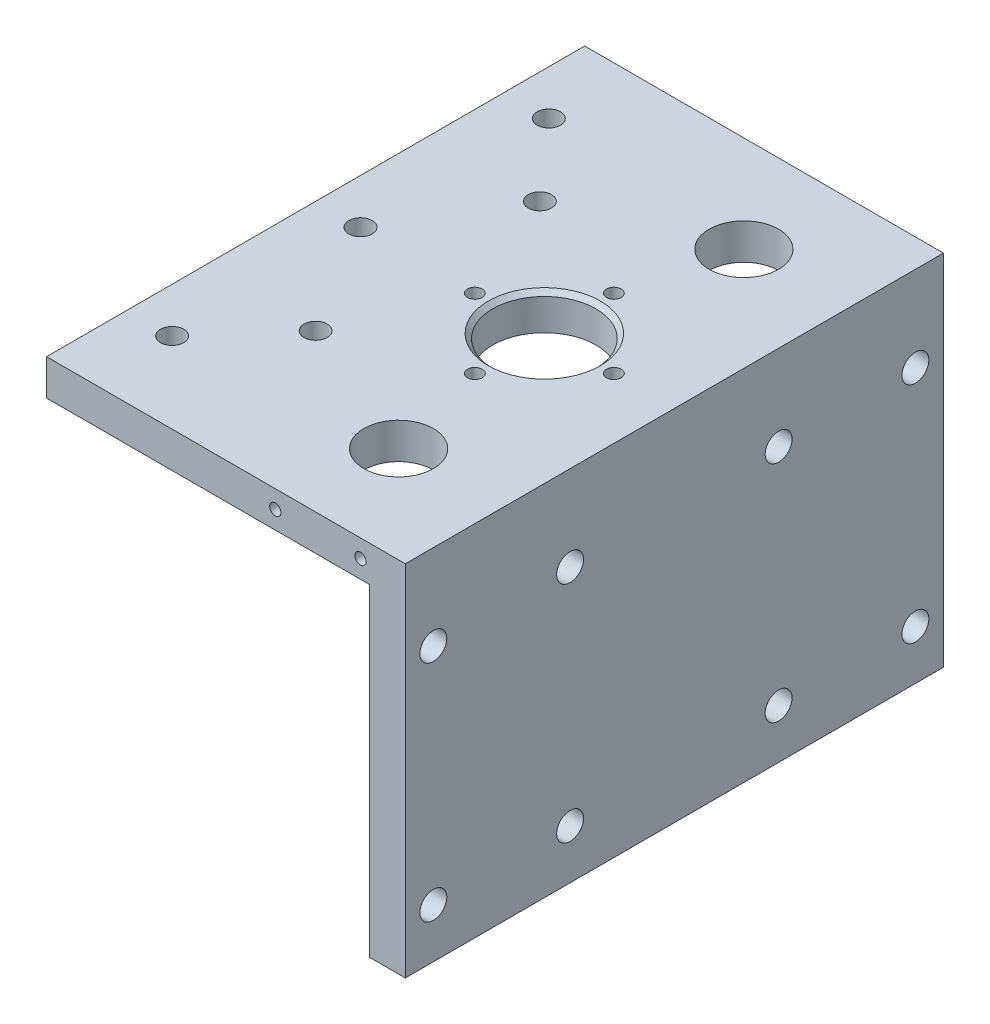
ISO-10303-21;
HEADER;
FILE_DESCRIPTION(('STEP AP214'),'2;1');
FILE_NAME('part.step','',(''),(''),'','','');
FILE_SCHEMA(('AUTOMOTIVE_DESIGN { 1 0 10303 214 1 1 1 1 }'));
ENDSEC;
DATA;
#1=APPLICATION_CONTEXT('core data for automotive mechanical design processes');
#2=APPLICATION_PROTOCOL_DEFINITION('international standard','automotive_design',2000,#1);
#3=PRODUCT_CONTEXT('',#1,'mechanical');
#4=PRODUCT('Part','Part','',(#3));
#5=PRODUCT_RELATED_PRODUCT_CATEGORY('part','',(#4));
#6=PRODUCT_DEFINITION_FORMATION('','',#4);
#7=PRODUCT_DEFINITION_CONTEXT('part definition',#1,'design');
#8=PRODUCT_DEFINITION('design','',#6,#7);
#9=PRODUCT_DEFINITION_SHAPE('','',#8);
#10=(LENGTH_UNIT() NAMED_UNIT(*) SI_UNIT(.MILLI.,.METRE.));
#11=(NAMED_UNIT(*) PLANE_ANGLE_UNIT() SI_UNIT($,.RADIAN.));
#12=(NAMED_UNIT(*) SI_UNIT($,.STERADIAN.) SOLID_ANGLE_UNIT());
#13=UNCERTAINTY_MEASURE_WITH_UNIT(LENGTH_MEASURE(1.E-05),#10,'distance_accuracy_value','');
#14=(GEOMETRIC_REPRESENTATION_CONTEXT(3) GLOBAL_UNCERTAINTY_ASSIGNED_CONTEXT((#13)) GLOBAL_UNIT_ASSIGNED_CONTEXT((#10,
#11,#12)) REPRESENTATION_CONTEXT('',''));
#15=CARTESIAN_POINT('',(0.,0.,0.));
#16=DIRECTION('',(0.,0.,1.));
#17=DIRECTION('',(1.,0.,0.));
#18=AXIS2_PLACEMENT_3D('',#15,#16,#17);
#19=CARTESIAN_POINT('',(0.,0.,120.));
#20=DIRECTION('',(0.,-1.,0.));
#21=DIRECTION('',(1.,0.,0.));
#22=AXIS2_PLACEMENT_3D('',#19,#20,#21);
#23=PLANE('',#22);
#24=CARTESIAN_POINT('',(-29.,0.,60.));
#25=DIRECTION('',(0.,-1.,0.));
#26=DIRECTION('',(1.,0.,0.));
#27=AXIS2_PLACEMENT_3D('',#24,#25,#26);
#28=CIRCLE('',#27,12.5);
#29=CARTESIAN_POINT('',(-16.5,0.,60.));
#30=VERTEX_POINT('',#29);
#31=EDGE_CURVE('E12',#30,#30,#28,.T.);
#32=ORIENTED_EDGE('',*,*,#31,.T.);
#33=EDGE_LOOP('',(#32));
#34=FACE_BOUND('',#33,.T.);
#35=CARTESIAN_POINT('',(-55.,0.,85.));
#36=DIRECTION('',(0.,1.,0.));
#37=DIRECTION('',(-1.,0.,0.));
#38=AXIS2_PLACEMENT_3D('',#35,#36,#37);
#39=CIRCLE('',#38,2.6);
#40=CARTESIAN_POINT('',(-57.6,0.,85.));
#41=VERTEX_POINT('',#40);
#42=EDGE_CURVE('E221',#41,#41,#39,.T.);
#43=ORIENTED_EDGE('',*,*,#42,.F.);
#44=EDGE_LOOP('',(#43));
#45=FACE_BOUND('',#44,.T.);
#46=CARTESIAN_POINT('',(-55.,0.,35.));
#47=DIRECTION('',(0.,1.,0.));
#48=DIRECTION('',(-1.,0.,0.));
#49=AXIS2_PLACEMENT_3D('',#46,#47,#48);
#50=CIRCLE('',#49,2.6);
#51=CARTESIAN_POINT('',(-57.6,0.,35.));
#52=VERTEX_POINT('',#51);
#53=EDGE_CURVE('E218',#52,#52,#50,.T.);
#54=ORIENTED_EDGE('',*,*,#53,.F.);
#55=EDGE_LOOP('',(#54));
#56=FACE_BOUND('',#55,.T.);
#57=CARTESIAN_POINT('',(-70.,0.,102.));
#58=DIRECTION('',(0.,1.,0.));
#59=DIRECTION('',(-1.,0.,0.));
#60=AXIS2_PLACEMENT_3D('',#57,#58,#59);
#61=CIRCLE('',#60,2.6);
#62=CARTESIAN_POINT('',(-72.6,0.,102.));
#63=VERTEX_POINT('',#62);
#64=EDGE_CURVE('E214',#63,#63,#61,.T.);
#65=ORIENTED_EDGE('',*,*,#64,.F.);
#66=EDGE_LOOP('',(#65));
#67=FACE_BOUND('',#66,.T.);
#68=CARTESIAN_POINT('',(-70.,0.,60.));
#69=DIRECTION('',(0.,1.,0.));
#70=DIRECTION('',(-1.,0.,0.));
#71=AXIS2_PLACEMENT_3D('',#68,#69,#70);
#72=CIRCLE('',#71,2.6);
#73=CARTESIAN_POINT('',(-72.6,0.,60.));
#74=VERTEX_POINT('',#73);
#75=EDGE_CURVE('E210',#74,#74,#72,.T.);
#76=ORIENTED_EDGE('',*,*,#75,.F.);
#77=EDGE_LOOP('',(#76));
#78=FACE_BOUND('',#77,.T.);
#79=CARTESIAN_POINT('',(-70.,0.,18.));
#80=DIRECTION('',(0.,1.,0.));
#81=DIRECTION('',(-1.,0.,0.));
#82=AXIS2_PLACEMENT_3D('',#79,#80,#81);
#83=CIRCLE('',#82,2.6);
#84=CARTESIAN_POINT('',(-72.6,0.,18.));
#85=VERTEX_POINT('',#84);
#86=EDGE_CURVE('E206',#85,#85,#83,.T.);
#87=ORIENTED_EDGE('',*,*,#86,.F.);
#88=EDGE_LOOP('',(#87));
#89=FACE_BOUND('',#88,.T.);
#90=CARTESIAN_POINT('',(-29.,0.,44.5));
#91=DIRECTION('',(0.,1.,0.));
#92=DIRECTION('',(0.,0.,1.));
#93=AXIS2_PLACEMENT_3D('',#90,#91,#92);
#94=CIRCLE('',#93,1.64999999999999);
#95=CARTESIAN_POINT('',(-29.,0.,46.15));
#96=VERTEX_POINT('',#95);
#97=EDGE_CURVE('E170',#96,#96,#94,.T.);
#98=ORIENTED_EDGE('',*,*,#97,.F.);
#99=EDGE_LOOP('',(#98));
#100=FACE_BOUND('',#99,.T.);
#101=CARTESIAN_POINT('',(-44.5,0.,60.));
#102=DIRECTION('',(0.,1.,0.));
#103=DIRECTION('',(0.,0.,1.));
#104=AXIS2_PLACEMENT_3D('',#101,#102,#103);
#105=CIRCLE('',#104,1.64999999999999);
#106=CARTESIAN_POINT('',(-44.5,0.,61.65));
#107=VERTEX_POINT('',#106);
#108=EDGE_CURVE('E169',#107,#107,#105,.T.);
#109=ORIENTED_EDGE('',*,*,#108,.F.);
#110=EDGE_LOOP('',(#109));
#111=FACE_BOUND('',#110,.T.);
#112=CARTESIAN_POINT('',(-29.,0.,75.5));
#113=DIRECTION('',(0.,1.,0.));
#114=DIRECTION('',(0.,0.,1.));
#115=AXIS2_PLACEMENT_3D('',#112,#113,#114);
#116=CIRCLE('',#115,1.64999999999999);
#117=CARTESIAN_POINT('',(-29.,0.,77.15));
#118=VERTEX_POINT('',#117);
#119=EDGE_CURVE('E510',#118,#118,#116,.T.);
#120=ORIENTED_EDGE('',*,*,#119,.F.);
#121=EDGE_LOOP('',(#120));
#122=FACE_BOUND('',#121,.T.);
#123=CARTESIAN_POINT('',(-23.,0.,98.5));
#124=DIRECTION('',(0.,1.,0.));
#125=DIRECTION('',(-1.,0.,0.));
#126=AXIS2_PLACEMENT_3D('',#123,#124,#125);
#127=CIRCLE('',#126,7.75000000000001);
#128=CARTESIAN_POINT('',(-30.75,0.,98.5));
#129=VERTEX_POINT('',#128);
#130=EDGE_CURVE('E480',#129,#129,#127,.T.);
#131=ORIENTED_EDGE('',*,*,#130,.F.);
#132=EDGE_LOOP('',(#131));
#133=FACE_BOUND('',#132,.T.);
#134=CARTESIAN_POINT('',(-23.,0.,21.5));
#135=DIRECTION('',(0.,1.,0.));
#136=DIRECTION('',(-1.,0.,0.));
#137=AXIS2_PLACEMENT_3D('',#134,#135,#136);
#138=CIRCLE('',#137,7.75);
#139=CARTESIAN_POINT('',(-30.75,0.,21.5));
#140=VERTEX_POINT('',#139);
#141=EDGE_CURVE('E463',#140,#140,#138,.T.);
#142=ORIENTED_EDGE('',*,*,#141,.F.);
#143=EDGE_LOOP('',(#142));
#144=FACE_BOUND('',#143,.T.);
#145=DIRECTION('',(-1.,0.,0.));
#146=VECTOR('',#145,1.);
#147=CARTESIAN_POINT('',(0.,0.,0.));
#148=LINE('',#147,#146);
#149=CARTESIAN_POINT('',(0.,0.,0.));
#150=VERTEX_POINT('',#149);
#151=CARTESIAN_POINT('',(-80.,0.,0.));
#152=VERTEX_POINT('',#151);
#153=EDGE_CURVE('E139',#150,#152,#148,.T.);
#154=ORIENTED_EDGE('',*,*,#153,.T.);
#155=DIRECTION('',(0.,0.,-1.));
#156=VECTOR('',#155,1.);
#157=CARTESIAN_POINT('',(-80.,0.,120.));
#158=LINE('',#157,#156);
#159=CARTESIAN_POINT('',(-80.,0.,120.));
#160=VERTEX_POINT('',#159);
#161=EDGE_CURVE('E154',#160,#152,#158,.T.);
#162=ORIENTED_EDGE('',*,*,#161,.F.);
#163=DIRECTION('',(-1.,0.,0.));
#164=VECTOR('',#163,1.);
#165=CARTESIAN_POINT('',(0.,0.,120.));
#166=LINE('',#165,#164);
#167=CARTESIAN_POINT('',(0.,0.,120.));
#168=VERTEX_POINT('',#167);
#169=EDGE_CURVE('E103',#168,#160,#166,.T.);
#170=ORIENTED_EDGE('',*,*,#169,.F.);
#171=DIRECTION('',(0.,0.,-1.));
#172=VECTOR('',#171,1.);
#173=CARTESIAN_POINT('',(0.,0.,120.));
#174=LINE('',#173,#172);
#175=EDGE_CURVE('E159',#168,#150,#174,.T.);
#176=ORIENTED_EDGE('',*,*,#175,.T.);
#177=EDGE_LOOP('',(#154,#162,#170,#176));
#178=FACE_BOUND('',#177,.T.);
#179=CARTESIAN_POINT('',(-13.5,0.,60.));
#180=DIRECTION('',(0.,1.,0.));
#181=DIRECTION('',(0.,0.,1.));
#182=AXIS2_PLACEMENT_3D('',#179,#180,#181);
#183=CIRCLE('',#182,1.64999999999999);
#184=CARTESIAN_POINT('',(-13.5,0.,61.65));
#185=VERTEX_POINT('',#184);
#186=EDGE_CURVE('E165',#185,#185,#183,.T.);
#187=ORIENTED_EDGE('',*,*,#186,.F.);
#188=EDGE_LOOP('',(#187));
#189=FACE_BOUND('',#188,.T.);
#190=ADVANCED_FACE('F45',(#34,#45,#56,#67,#78,#89,#100,#111,#122,#133,#144,#178,#189),#23,.F.);
#191=CARTESIAN_POINT('',(0.,-80.,120.));
#192=DIRECTION('',(-1.,0.,0.));
#193=DIRECTION('',(0.,0.,1.));
#194=AXIS2_PLACEMENT_3D('',#191,#192,#193);
#195=PLANE('',#194);
#196=CARTESIAN_POINT('',(0.,-69.,36.75));
#197=DIRECTION('',(1.,0.,0.));
#198=DIRECTION('',(0.,0.,1.));
#199=AXIS2_PLACEMENT_3D('',#196,#197,#198);
#200=CIRCLE('',#199,3.);
#201=CARTESIAN_POINT('',(0.,-69.,39.75));
#202=VERTEX_POINT('',#201);
#203=EDGE_CURVE('E202',#202,#202,#200,.T.);
#204=ORIENTED_EDGE('',*,*,#203,.F.);
#205=EDGE_LOOP('',(#204));
#206=FACE_BOUND('',#205,.T.);
#207=CARTESIAN_POINT('',(0.,-69.,6.25));
#208=DIRECTION('',(1.,0.,0.));
#209=DIRECTION('',(0.,0.,-1.));
#210=AXIS2_PLACEMENT_3D('',#207,#208,#209);
#211=CIRCLE('',#210,3.);
#212=CARTESIAN_POINT('',(0.,-69.,3.25));
#213=VERTEX_POINT('',#212);
#214=EDGE_CURVE('E198',#213,#213,#211,.T.);
#215=ORIENTED_EDGE('',*,*,#214,.F.);
#216=EDGE_LOOP('',(#215));
#217=FACE_BOUND('',#216,.T.);
#218=CARTESIAN_POINT('',(0.,-69.,113.75));
#219=DIRECTION('',(1.,0.,0.));
#220=DIRECTION('',(0.,0.,1.));
#221=AXIS2_PLACEMENT_3D('',#218,#219,#220);
#222=CIRCLE('',#221,3.00000000000001);
#223=CARTESIAN_POINT('',(0.,-69.,116.75));
#224=VERTEX_POINT('',#223);
#225=EDGE_CURVE('E194',#224,#224,#222,.T.);
#226=ORIENTED_EDGE('',*,*,#225,.F.);
#227=EDGE_LOOP('',(#226));
#228=FACE_BOUND('',#227,.T.);
#229=CARTESIAN_POINT('',(0.,-69.,83.25));
#230=DIRECTION('',(1.,0.,0.));
#231=DIRECTION('',(0.,0.,-1.));
#232=AXIS2_PLACEMENT_3D('',#229,#230,#231);
#233=CIRCLE('',#232,3.00000000000001);
#234=CARTESIAN_POINT('',(0.,-69.,80.25));
#235=VERTEX_POINT('',#234);
#236=EDGE_CURVE('E190',#235,#235,#233,.T.);
#237=ORIENTED_EDGE('',*,*,#236,.F.);
#238=EDGE_LOOP('',(#237));
#239=FACE_BOUND('',#238,.T.);
#240=CARTESIAN_POINT('',(0.,-19.,6.25));
#241=DIRECTION('',(1.,0.,0.));
#242=DIRECTION('',(0.,0.,1.));
#243=AXIS2_PLACEMENT_3D('',#240,#241,#242);
#244=CIRCLE('',#243,3.);
#245=CARTESIAN_POINT('',(0.,-19.,9.25));
#246=VERTEX_POINT('',#245);
#247=EDGE_CURVE('E186',#246,#246,#244,.T.);
#248=ORIENTED_EDGE('',*,*,#247,.F.);
#249=EDGE_LOOP('',(#248));
#250=FACE_BOUND('',#249,.T.);
#251=CARTESIAN_POINT('',(0.,-19.,36.75));
#252=DIRECTION('',(1.,0.,0.));
#253=DIRECTION('',(0.,0.,-1.));
#254=AXIS2_PLACEMENT_3D('',#251,#252,#253);
#255=CIRCLE('',#254,3.);
#256=CARTESIAN_POINT('',(0.,-19.,33.75));
#257=VERTEX_POINT('',#256);
#258=EDGE_CURVE('E182',#257,#257,#255,.T.);
#259=ORIENTED_EDGE('',*,*,#258,.F.);
#260=EDGE_LOOP('',(#259));
#261=FACE_BOUND('',#260,.T.);
#262=CARTESIAN_POINT('',(0.,-19.,113.75));
#263=DIRECTION('',(1.,0.,0.));
#264=DIRECTION('',(0.,0.,-1.));
#265=AXIS2_PLACEMENT_3D('',#262,#263,#264);
#266=CIRCLE('',#265,3.00000000000001);
#267=CARTESIAN_POINT('',(0.,-19.,110.75));
#268=VERTEX_POINT('',#267);
#269=EDGE_CURVE('E178',#268,#268,#266,.T.);
#270=ORIENTED_EDGE('',*,*,#269,.F.);
#271=EDGE_LOOP('',(#270));
#272=FACE_BOUND('',#271,.T.);
#273=CARTESIAN_POINT('',(0.,-19.,83.25));
#274=DIRECTION('',(1.,0.,0.));
#275=DIRECTION('',(0.,0.,1.));
#276=AXIS2_PLACEMENT_3D('',#273,#274,#275);
#277=CIRCLE('',#276,3.00000000000001);
#278=CARTESIAN_POINT('',(0.,-19.,86.25));
#279=VERTEX_POINT('',#278);
#280=EDGE_CURVE('E174',#279,#279,#277,.T.);
#281=ORIENTED_EDGE('',*,*,#280,.F.);
#282=EDGE_LOOP('',(#281));
#283=FACE_BOUND('',#282,.T.);
#284=DIRECTION('',(0.,1.,0.));
#285=VECTOR('',#284,1.);
#286=CARTESIAN_POINT('',(0.,-80.,0.));
#287=LINE('',#286,#285);
#288=CARTESIAN_POINT('',(0.,-80.,0.));
#289=VERTEX_POINT('',#288);
#290=EDGE_CURVE('E136',#289,#150,#287,.T.);
#291=ORIENTED_EDGE('',*,*,#290,.T.);
#292=ORIENTED_EDGE('',*,*,#175,.F.);
#293=DIRECTION('',(0.,1.,0.));
#294=VECTOR('',#293,1.);
#295=CARTESIAN_POINT('',(0.,-80.,120.));
#296=LINE('',#295,#294);
#297=CARTESIAN_POINT('',(0.,-80.,120.));
#298=VERTEX_POINT('',#297);
#299=EDGE_CURVE('E576',#298,#168,#296,.T.);
#300=ORIENTED_EDGE('',*,*,#299,.F.);
#301=DIRECTION('',(0.,0.,-1.));
#302=VECTOR('',#301,1.);
#303=CARTESIAN_POINT('',(0.,-80.,120.));
#304=LINE('',#303,#302);
#305=EDGE_CURVE('E132',#298,#289,#304,.T.);
#306=ORIENTED_EDGE('',*,*,#305,.T.);
#307=EDGE_LOOP('',(#291,#292,#300,#306));
#308=FACE_BOUND('',#307,.T.);
#309=ADVANCED_FACE('F247',(#206,#217,#228,#239,#250,#261,#272,#283,#308),#195,.F.);
#310=CARTESIAN_POINT('',(-80.,0.,120.));
#311=DIRECTION('',(1.,0.,0.));
#312=DIRECTION('',(0.,0.,-1.));
#313=AXIS2_PLACEMENT_3D('',#310,#311,#312);
#314=PLANE('',#313);
#315=DIRECTION('',(0.,-1.,0.));
#316=VECTOR('',#315,1.);
#317=CARTESIAN_POINT('',(-80.,0.,0.));
#318=LINE('',#317,#316);
#319=CARTESIAN_POINT('',(-80.,-8.00000000000001,0.));
#320=VERTEX_POINT('',#319);
#321=EDGE_CURVE('E143',#152,#320,#318,.T.);
#322=ORIENTED_EDGE('',*,*,#321,.T.);
#323=DIRECTION('',(0.,0.,-1.));
#324=VECTOR('',#323,1.);
#325=CARTESIAN_POINT('',(-80.,-8.00000000000001,120.));
#326=LINE('',#325,#324);
#327=CARTESIAN_POINT('',(-80.,-8.00000000000001,120.));
#328=VERTEX_POINT('',#327);
#329=EDGE_CURVE('E127',#328,#320,#326,.T.);
#330=ORIENTED_EDGE('',*,*,#329,.F.);
#331=DIRECTION('',(0.,-1.,0.));
#332=VECTOR('',#331,1.);
#333=CARTESIAN_POINT('',(-80.,0.,120.));
#334=LINE('',#333,#332);
#335=EDGE_CURVE('E118',#160,#328,#334,.T.);
#336=ORIENTED_EDGE('',*,*,#335,.F.);
#337=ORIENTED_EDGE('',*,*,#161,.T.);
#338=EDGE_LOOP('',(#322,#330,#336,#337));
#339=FACE_BOUND('',#338,.T.);
#340=ADVANCED_FACE('F253',(#339),#314,.F.);
#341=CARTESIAN_POINT('',(-80.,-8.00000000000001,120.));
#342=DIRECTION('',(0.,1.,0.));
#343=DIRECTION('',(0.,0.,1.));
#344=AXIS2_PLACEMENT_3D('',#341,#342,#343);
#345=PLANE('',#344);
#346=CARTESIAN_POINT('',(-55.,-8.00000000000001,85.));
#347=DIRECTION('',(0.,1.,0.));
#348=DIRECTION('',(0.,0.,1.));
#349=AXIS2_PLACEMENT_3D('',#346,#347,#348);
#350=CIRCLE('',#349,2.6);
#351=CARTESIAN_POINT('',(-55.,-8.00000000000001,87.6));
#352=VERTEX_POINT('',#351);
#353=EDGE_CURVE('E219',#352,#352,#350,.T.);
#354=ORIENTED_EDGE('',*,*,#353,.T.);
#355=EDGE_LOOP('',(#354));
#356=FACE_BOUND('',#355,.T.);
#357=CARTESIAN_POINT('',(-55.,-8.00000000000001,35.));
#358=DIRECTION('',(0.,1.,0.));
#359=DIRECTION('',(0.,0.,1.));
#360=AXIS2_PLACEMENT_3D('',#357,#358,#359);
#361=CIRCLE('',#360,2.6);
#362=CARTESIAN_POINT('',(-55.,-8.00000000000001,37.6));
#363=VERTEX_POINT('',#362);
#364=EDGE_CURVE('E215',#363,#363,#361,.T.);
#365=ORIENTED_EDGE('',*,*,#364,.T.);
#366=EDGE_LOOP('',(#365));
#367=FACE_BOUND('',#366,.T.);
#368=CARTESIAN_POINT('',(-70.,-8.00000000000001,102.));
#369=DIRECTION('',(0.,1.,0.));
#370=DIRECTION('',(0.,0.,1.));
#371=AXIS2_PLACEMENT_3D('',#368,#369,#370);
#372=CIRCLE('',#371,2.6);
#373=CARTESIAN_POINT('',(-70.,-8.00000000000001,104.6));
#374=VERTEX_POINT('',#373);
#375=EDGE_CURVE('E211',#374,#374,#372,.T.);
#376=ORIENTED_EDGE('',*,*,#375,.T.);
#377=EDGE_LOOP('',(#376));
#378=FACE_BOUND('',#377,.T.);
#379=CARTESIAN_POINT('',(-70.,-8.00000000000001,60.));
#380=DIRECTION('',(0.,1.,0.));
#381=DIRECTION('',(0.,0.,1.));
#382=AXIS2_PLACEMENT_3D('',#379,#380,#381);
#383=CIRCLE('',#382,2.6);
#384=CARTESIAN_POINT('',(-70.,-8.00000000000001,62.6));
#385=VERTEX_POINT('',#384);
#386=EDGE_CURVE('E207',#385,#385,#383,.T.);
#387=ORIENTED_EDGE('',*,*,#386,.T.);
#388=EDGE_LOOP('',(#387));
#389=FACE_BOUND('',#388,.T.);
#390=CARTESIAN_POINT('',(-70.,-8.00000000000001,18.));
#391=DIRECTION('',(0.,1.,0.));
#392=DIRECTION('',(0.,0.,1.));
#393=AXIS2_PLACEMENT_3D('',#390,#391,#392);
#394=CIRCLE('',#393,2.6);
#395=CARTESIAN_POINT('',(-70.,-8.00000000000001,20.6));
#396=VERTEX_POINT('',#395);
#397=EDGE_CURVE('E203',#396,#396,#394,.T.);
#398=ORIENTED_EDGE('',*,*,#397,.T.);
#399=EDGE_LOOP('',(#398));
#400=FACE_BOUND('',#399,.T.);
#401=CARTESIAN_POINT('',(-29.,-8.00000000000001,44.5));
#402=DIRECTION('',(0.,1.,0.));
#403=DIRECTION('',(0.,0.,1.));
#404=AXIS2_PLACEMENT_3D('',#401,#402,#403);
#405=CIRCLE('',#404,1.64999999999999);
#406=CARTESIAN_POINT('',(-29.,-8.00000000000001,46.15));
#407=VERTEX_POINT('',#406);
#408=EDGE_CURVE('E166',#407,#407,#405,.T.);
#409=ORIENTED_EDGE('',*,*,#408,.T.);
#410=EDGE_LOOP('',(#409));
#411=FACE_BOUND('',#410,.T.);
#412=CARTESIAN_POINT('',(-44.5,-8.00000000000001,60.));
#413=DIRECTION('',(0.,1.,0.));
#414=DIRECTION('',(0.,0.,1.));
#415=AXIS2_PLACEMENT_3D('',#412,#413,#414);
#416=CIRCLE('',#415,1.64999999999998);
#417=CARTESIAN_POINT('',(-44.5,-8.00000000000001,61.65));
#418=VERTEX_POINT('',#417);
#419=EDGE_CURVE('E515',#418,#418,#416,.T.);
#420=ORIENTED_EDGE('',*,*,#419,.T.);
#421=EDGE_LOOP('',(#420));
#422=FACE_BOUND('',#421,.T.);
#423=CARTESIAN_POINT('',(-29.,-8.00000000000001,75.5));
#424=DIRECTION('',(0.,1.,0.));
#425=DIRECTION('',(0.,0.,1.));
#426=AXIS2_PLACEMENT_3D('',#423,#424,#425);
#427=CIRCLE('',#426,1.64999999999999);
#428=CARTESIAN_POINT('',(-29.,-8.00000000000001,77.15));
#429=VERTEX_POINT('',#428);
#430=EDGE_CURVE('E500',#429,#429,#427,.T.);
#431=ORIENTED_EDGE('',*,*,#430,.T.);
#432=EDGE_LOOP('',(#431));
#433=FACE_BOUND('',#432,.T.);
#434=CARTESIAN_POINT('',(-13.5,-8.00000000000001,60.));
#435=DIRECTION('',(0.,1.,0.));
#436=DIRECTION('',(0.,0.,1.));
#437=AXIS2_PLACEMENT_3D('',#434,#435,#436);
#438=CIRCLE('',#437,1.64999999999999);
#439=CARTESIAN_POINT('',(-13.5,-8.00000000000001,61.65));
#440=VERTEX_POINT('',#439);
#441=EDGE_CURVE('E161',#440,#440,#438,.T.);
#442=ORIENTED_EDGE('',*,*,#441,.T.);
#443=EDGE_LOOP('',(#442));
#444=FACE_BOUND('',#443,.T.);
#445=CARTESIAN_POINT('',(-29.,-8.00000000000001,60.));
#446=DIRECTION('',(0.,1.,0.));
#447=DIRECTION('',(0.,0.,1.));
#448=AXIS2_PLACEMENT_3D('',#445,#446,#447);
#449=CIRCLE('',#448,11.5);
#450=CARTESIAN_POINT('',(-29.,-8.00000000000001,71.5));
#451=VERTEX_POINT('',#450);
#452=EDGE_CURVE('E164',#451,#451,#449,.F.);
#453=ORIENTED_EDGE('',*,*,#452,.F.);
#454=EDGE_LOOP('',(#453));
#455=FACE_BOUND('',#454,.T.);
#456=CARTESIAN_POINT('',(-23.,-8.00000000000001,98.5));
#457=DIRECTION('',(0.,1.,0.));
#458=DIRECTION('',(0.,0.,1.));
#459=AXIS2_PLACEMENT_3D('',#456,#457,#458);
#460=CIRCLE('',#459,7.75000000000001);
#461=CARTESIAN_POINT('',(-23.,-8.00000000000001,106.25));
#462=VERTEX_POINT('',#461);
#463=EDGE_CURVE('E468',#462,#462,#460,.F.);
#464=ORIENTED_EDGE('',*,*,#463,.F.);
#465=EDGE_LOOP('',(#464));
#466=FACE_BOUND('',#465,.T.);
#467=CARTESIAN_POINT('',(-23.,-8.00000000000001,21.5));
#468=DIRECTION('',(0.,1.,0.));
#469=DIRECTION('',(0.,0.,1.));
#470=AXIS2_PLACEMENT_3D('',#467,#468,#469);
#471=CIRCLE('',#470,7.75);
#472=CARTESIAN_POINT('',(-23.,-8.00000000000001,29.25));
#473=VERTEX_POINT('',#472);
#474=EDGE_CURVE('E140',#473,#473,#471,.F.);
#475=ORIENTED_EDGE('',*,*,#474,.F.);
#476=EDGE_LOOP('',(#475));
#477=FACE_BOUND('',#476,.T.);
#478=DIRECTION('',(1.,0.,0.));
#479=VECTOR('',#478,1.);
#480=CARTESIAN_POINT('',(-80.,-8.00000000000001,0.));
#481=LINE('',#480,#479);
#482=CARTESIAN_POINT('',(-8.00000000000001,-8.00000000000001,0.));
#483=VERTEX_POINT('',#482);
#484=EDGE_CURVE('E126',#320,#483,#481,.T.);
#485=ORIENTED_EDGE('',*,*,#484,.T.);
#486=DIRECTION('',(0.,0.,-1.));
#487=VECTOR('',#486,1.);
#488=CARTESIAN_POINT('',(-8.00000000000001,-8.00000000000001,120.));
#489=LINE('',#488,#487);
#490=CARTESIAN_POINT('',(-8.00000000000001,-8.00000000000001,120.));
#491=VERTEX_POINT('',#490);
#492=EDGE_CURVE('E123',#491,#483,#489,.T.);
#493=ORIENTED_EDGE('',*,*,#492,.F.);
#494=DIRECTION('',(1.,0.,0.));
#495=VECTOR('',#494,1.);
#496=CARTESIAN_POINT('',(-80.,-8.00000000000001,120.));
#497=LINE('',#496,#495);
#498=EDGE_CURVE('E112',#328,#491,#497,.T.);
#499=ORIENTED_EDGE('',*,*,#498,.F.);
#500=ORIENTED_EDGE('',*,*,#329,.T.);
#501=EDGE_LOOP('',(#485,#493,#499,#500));
#502=FACE_BOUND('',#501,.T.);
#503=ADVANCED_FACE('F124',(#356,#367,#378,#389,#400,#411,#422,#433,#444,#455,#466,#477,#502),
#345,.F.);
#504=CARTESIAN_POINT('',(-8.00000000000001,-8.00000000000001,120.));
#505=DIRECTION('',(1.,0.,0.));
#506=DIRECTION('',(0.,1.,0.));
#507=AXIS2_PLACEMENT_3D('',#504,#505,#506);
#508=PLANE('',#507);
#509=CARTESIAN_POINT('',(-8.,-69.,36.75));
#510=DIRECTION('',(1.,0.,0.));
#511=DIRECTION('',(0.,1.,0.));
#512=AXIS2_PLACEMENT_3D('',#509,#510,#511);
#513=CIRCLE('',#512,3.);
#514=CARTESIAN_POINT('',(-8.,-66.,36.75));
#515=VERTEX_POINT('',#514);
#516=EDGE_CURVE('E199',#515,#515,#513,.T.);
#517=ORIENTED_EDGE('',*,*,#516,.T.);
#518=EDGE_LOOP('',(#517));
#519=FACE_BOUND('',#518,.T.);
#520=CARTESIAN_POINT('',(-8.,-69.,6.25));
#521=DIRECTION('',(1.,0.,0.));
#522=DIRECTION('',(0.,1.,0.));
#523=AXIS2_PLACEMENT_3D('',#520,#521,#522);
#524=CIRCLE('',#523,3.);
#525=CARTESIAN_POINT('',(-8.,-66.,6.25));
#526=VERTEX_POINT('',#525);
#527=EDGE_CURVE('E195',#526,#526,#524,.T.);
#528=ORIENTED_EDGE('',*,*,#527,.T.);
#529=EDGE_LOOP('',(#528));
#530=FACE_BOUND('',#529,.T.);
#531=CARTESIAN_POINT('',(-8.,-69.,113.75));
#532=DIRECTION('',(1.,0.,0.));
#533=DIRECTION('',(0.,1.,0.));
#534=AXIS2_PLACEMENT_3D('',#531,#532,#533);
#535=CIRCLE('',#534,3.00000000000001);
#536=CARTESIAN_POINT('',(-8.,-66.,113.75));
#537=VERTEX_POINT('',#536);
#538=EDGE_CURVE('E191',#537,#537,#535,.T.);
#539=ORIENTED_EDGE('',*,*,#538,.T.);
#540=EDGE_LOOP('',(#539));
#541=FACE_BOUND('',#540,.T.);
#542=CARTESIAN_POINT('',(-8.,-69.,83.25));
#543=DIRECTION('',(1.,0.,0.));
#544=DIRECTION('',(0.,1.,0.));
#545=AXIS2_PLACEMENT_3D('',#542,#543,#544);
#546=CIRCLE('',#545,3.00000000000001);
#547=CARTESIAN_POINT('',(-8.,-66.,83.25));
#548=VERTEX_POINT('',#547);
#549=EDGE_CURVE('E187',#548,#548,#546,.T.);
#550=ORIENTED_EDGE('',*,*,#549,.T.);
#551=EDGE_LOOP('',(#550));
#552=FACE_BOUND('',#551,.T.);
#553=CARTESIAN_POINT('',(-8.00000000000001,-19.,6.25));
#554=DIRECTION('',(1.,0.,0.));
#555=DIRECTION('',(0.,1.,0.));
#556=AXIS2_PLACEMENT_3D('',#553,#554,#555);
#557=CIRCLE('',#556,3.);
#558=CARTESIAN_POINT('',(-8.00000000000001,-16.,6.25));
#559=VERTEX_POINT('',#558);
#560=EDGE_CURVE('E183',#559,#559,#557,.T.);
#561=ORIENTED_EDGE('',*,*,#560,.T.);
#562=EDGE_LOOP('',(#561));
#563=FACE_BOUND('',#562,.T.);
#564=CARTESIAN_POINT('',(-8.00000000000001,-19.,36.75));
#565=DIRECTION('',(1.,0.,0.));
#566=DIRECTION('',(0.,1.,0.));
#567=AXIS2_PLACEMENT_3D('',#564,#565,#566);
#568=CIRCLE('',#567,3.);
#569=CARTESIAN_POINT('',(-8.00000000000001,-16.,36.75));
#570=VERTEX_POINT('',#569);
#571=EDGE_CURVE('E179',#570,#570,#568,.T.);
#572=ORIENTED_EDGE('',*,*,#571,.T.);
#573=EDGE_LOOP('',(#572));
#574=FACE_BOUND('',#573,.T.);
#575=CARTESIAN_POINT('',(-8.00000000000001,-19.,113.75));
#576=DIRECTION('',(1.,0.,0.));
#577=DIRECTION('',(0.,1.,0.));
#578=AXIS2_PLACEMENT_3D('',#575,#576,#577);
#579=CIRCLE('',#578,3.00000000000001);
#580=CARTESIAN_POINT('',(-8.00000000000001,-16.,113.75));
#581=VERTEX_POINT('',#580);
#582=EDGE_CURVE('E175',#581,#581,#579,.T.);
#583=ORIENTED_EDGE('',*,*,#582,.T.);
#584=EDGE_LOOP('',(#583));
#585=FACE_BOUND('',#584,.T.);
#586=CARTESIAN_POINT('',(-8.00000000000001,-19.,83.25));
#587=DIRECTION('',(1.,0.,0.));
#588=DIRECTION('',(0.,1.,0.));
#589=AXIS2_PLACEMENT_3D('',#586,#587,#588);
#590=CIRCLE('',#589,3.00000000000001);
#591=CARTESIAN_POINT('',(-8.00000000000001,-16.,83.25));
#592=VERTEX_POINT('',#591);
#593=EDGE_CURVE('E171',#592,#592,#590,.T.);
#594=ORIENTED_EDGE('',*,*,#593,.T.);
#595=EDGE_LOOP('',(#594));
#596=FACE_BOUND('',#595,.T.);
#597=DIRECTION('',(0.,-1.,0.));
#598=VECTOR('',#597,1.);
#599=CARTESIAN_POINT('',(-8.00000000000001,-8.00000000000001,0.));
#600=LINE('',#599,#598);
#601=CARTESIAN_POINT('',(-8.,-80.,0.));
#602=VERTEX_POINT('',#601);
#603=EDGE_CURVE('E88',#483,#602,#600,.T.);
#604=ORIENTED_EDGE('',*,*,#603,.T.);
#605=DIRECTION('',(0.,0.,-1.));
#606=VECTOR('',#605,1.);
#607=CARTESIAN_POINT('',(-8.,-80.,120.));
#608=LINE('',#607,#606);
#609=CARTESIAN_POINT('',(-8.,-80.,120.));
#610=VERTEX_POINT('',#609);
#611=EDGE_CURVE('E128',#610,#602,#608,.T.);
#612=ORIENTED_EDGE('',*,*,#611,.F.);
#613=DIRECTION('',(0.,-1.,0.));
#614=VECTOR('',#613,1.);
#615=CARTESIAN_POINT('',(-8.00000000000001,-8.00000000000001,120.));
#616=LINE('',#615,#614);
#617=EDGE_CURVE('E116',#491,#610,#616,.T.);
#618=ORIENTED_EDGE('',*,*,#617,.F.);
#619=ORIENTED_EDGE('',*,*,#492,.T.);
#620=EDGE_LOOP('',(#604,#612,#618,#619));
#621=FACE_BOUND('',#620,.T.);
#622=ADVANCED_FACE('F130',(#519,#530,#541,#552,#563,#574,#585,#596,#621),#508,.F.);
#623=CARTESIAN_POINT('',(-8.,-80.,120.));
#624=DIRECTION('',(0.,1.,0.));
#625=DIRECTION('',(0.,0.,1.));
#626=AXIS2_PLACEMENT_3D('',#623,#624,#625);
#627=PLANE('',#626);
#628=DIRECTION('',(1.,0.,0.));
#629=VECTOR('',#628,1.);
#630=CARTESIAN_POINT('',(-8.,-80.,0.));
#631=LINE('',#630,#629);
#632=EDGE_CURVE('E94',#602,#289,#631,.T.);
#633=ORIENTED_EDGE('',*,*,#632,.T.);
#634=ORIENTED_EDGE('',*,*,#305,.F.);
#635=DIRECTION('',(1.,0.,0.));
#636=VECTOR('',#635,1.);
#637=CARTESIAN_POINT('',(-8.,-80.,120.));
#638=LINE('',#637,#636);
#639=EDGE_CURVE('E63',#610,#298,#638,.T.);
#640=ORIENTED_EDGE('',*,*,#639,.F.);
#641=ORIENTED_EDGE('',*,*,#611,.T.);
#642=EDGE_LOOP('',(#633,#634,#640,#641));
#643=FACE_BOUND('',#642,.T.);
#644=ADVANCED_FACE('F265',(#643),#627,.F.);
#645=CARTESIAN_POINT('',(0.,0.,120.));
#646=DIRECTION('',(0.,0.,1.));
#647=DIRECTION('',(1.,0.,0.));
#648=AXIS2_PLACEMENT_3D('',#645,#646,#647);
#649=PLANE('',#648);
#650=CARTESIAN_POINT('',(-10.,-4.00000000000002,120.));
#651=DIRECTION('',(0.,0.,1.));
#652=DIRECTION('',(1.,0.,0.));
#653=AXIS2_PLACEMENT_3D('',#650,#651,#652);
#654=CIRCLE('',#653,1.25);
#655=CARTESIAN_POINT('',(-8.75,-4.00000000000002,120.));
#656=VERTEX_POINT('',#655);
#657=EDGE_CURVE('E367',#656,#656,#654,.T.);
#658=ORIENTED_EDGE('',*,*,#657,.F.);
#659=EDGE_LOOP('',(#658));
#660=FACE_BOUND('',#659,.T.);
#661=CARTESIAN_POINT('',(-29.,-4.00000000000001,120.));
#662=DIRECTION('',(0.,0.,1.));
#663=DIRECTION('',(1.,0.,0.));
#664=AXIS2_PLACEMENT_3D('',#661,#662,#663);
#665=CIRCLE('',#664,1.25);
#666=CARTESIAN_POINT('',(-27.75,-4.00000000000001,120.));
#667=VERTEX_POINT('',#666);
#668=EDGE_CURVE('E369',#667,#667,#665,.T.);
#669=ORIENTED_EDGE('',*,*,#668,.F.);
#670=EDGE_LOOP('',(#669));
#671=FACE_BOUND('',#670,.T.);
#672=ORIENTED_EDGE('',*,*,#299,.T.);
#673=ORIENTED_EDGE('',*,*,#169,.T.);
#674=ORIENTED_EDGE('',*,*,#335,.T.);
#675=ORIENTED_EDGE('',*,*,#498,.T.);
#676=ORIENTED_EDGE('',*,*,#617,.T.);
#677=ORIENTED_EDGE('',*,*,#639,.T.);
#678=EDGE_LOOP('',(#672,#673,#674,#675,#676,#677));
#679=FACE_BOUND('',#678,.T.);
#680=ADVANCED_FACE('F114',(#660,#671,#679),#649,.T.);
#681=CARTESIAN_POINT('',(0.,0.,0.));
#682=DIRECTION('',(0.,0.,1.));
#683=DIRECTION('',(1.,0.,0.));
#684=AXIS2_PLACEMENT_3D('',#681,#682,#683);
#685=PLANE('',#684);
#686=ORIENTED_EDGE('',*,*,#290,.F.);
#687=ORIENTED_EDGE('',*,*,#632,.F.);
#688=ORIENTED_EDGE('',*,*,#603,.F.);
#689=ORIENTED_EDGE('',*,*,#484,.F.);
#690=ORIENTED_EDGE('',*,*,#321,.F.);
#691=ORIENTED_EDGE('',*,*,#153,.F.);
#692=EDGE_LOOP('',(#686,#687,#688,#689,#690,#691));
#693=FACE_BOUND('',#692,.T.);
#694=ADVANCED_FACE('F269',(#693),#685,.F.);
#695=CARTESIAN_POINT('',(-23.,-80.001,21.5));
#696=DIRECTION('',(0.,1.,0.));
#697=DIRECTION('',(-1.,0.,0.));
#698=AXIS2_PLACEMENT_3D('',#695,#696,#697);
#699=CYLINDRICAL_SURFACE('',#698,7.75);
#700=ORIENTED_EDGE('',*,*,#141,.T.);
#701=EDGE_LOOP('',(#700));
#702=FACE_BOUND('',#701,.T.);
#703=ORIENTED_EDGE('',*,*,#474,.T.);
#704=EDGE_LOOP('',(#703));
#705=FACE_BOUND('',#704,.T.);
#706=ADVANCED_FACE('F272',(#702,#705),#699,.F.);
#707=CARTESIAN_POINT('',(-23.,-80.001,98.5));
#708=DIRECTION('',(0.,1.,0.));
#709=DIRECTION('',(-1.,0.,0.));
#710=AXIS2_PLACEMENT_3D('',#707,#708,#709);
#711=CYLINDRICAL_SURFACE('',#710,7.75000000000001);
#712=ORIENTED_EDGE('',*,*,#130,.T.);
#713=EDGE_LOOP('',(#712));
#714=FACE_BOUND('',#713,.T.);
#715=ORIENTED_EDGE('',*,*,#463,.T.);
#716=EDGE_LOOP('',(#715));
#717=FACE_BOUND('',#716,.T.);
#718=ADVANCED_FACE('F279',(#714,#717),#711,.F.);
#719=CARTESIAN_POINT('',(-29.,-80.001,60.));
#720=DIRECTION('',(0.,1.,0.));
#721=DIRECTION('',(-1.,0.,0.));
#722=AXIS2_PLACEMENT_3D('',#719,#720,#721);
#723=CYLINDRICAL_SURFACE('',#722,11.5);
#724=CARTESIAN_POINT('',(-29.,-1.00000000000004,60.));
#725=DIRECTION('',(0.,-1.,0.));
#726=DIRECTION('',(0.,0.,-1.));
#727=AXIS2_PLACEMENT_3D('',#724,#725,#726);
#728=CIRCLE('',#727,11.5);
#729=CARTESIAN_POINT('',(-29.,-1.00000000000004,48.5));
#730=VERTEX_POINT('',#729);
#731=EDGE_CURVE('E55',#730,#730,#728,.F.);
#732=ORIENTED_EDGE('',*,*,#731,.T.);
#733=EDGE_LOOP('',(#732));
#734=FACE_BOUND('',#733,.T.);
#735=ORIENTED_EDGE('',*,*,#452,.T.);
#736=EDGE_LOOP('',(#735));
#737=FACE_BOUND('',#736,.T.);
#738=ADVANCED_FACE('F228',(#734,#737),#723,.F.);
#739=CARTESIAN_POINT('',(-13.5,0.,60.));
#740=DIRECTION('',(0.,1.,0.));
#741=DIRECTION('',(0.,0.,1.));
#742=AXIS2_PLACEMENT_3D('',#739,#740,#741);
#743=CYLINDRICAL_SURFACE('',#742,1.64999999999999);
#744=ORIENTED_EDGE('',*,*,#186,.T.);
#745=EDGE_LOOP('',(#744));
#746=FACE_BOUND('',#745,.T.);
#747=ORIENTED_EDGE('',*,*,#441,.F.);
#748=EDGE_LOOP('',(#747));
#749=FACE_BOUND('',#748,.T.);
#750=ADVANCED_FACE('F286',(#746,#749),#743,.F.);
#751=CARTESIAN_POINT('',(-29.,0.,75.5));
#752=DIRECTION('',(0.,1.,0.));
#753=DIRECTION('',(0.,0.,1.));
#754=AXIS2_PLACEMENT_3D('',#751,#752,#753);
#755=CYLINDRICAL_SURFACE('',#754,1.64999999999999);
#756=ORIENTED_EDGE('',*,*,#119,.T.);
#757=EDGE_LOOP('',(#756));
#758=FACE_BOUND('',#757,.T.);
#759=ORIENTED_EDGE('',*,*,#430,.F.);
#760=EDGE_LOOP('',(#759));
#761=FACE_BOUND('',#760,.T.);
#762=ADVANCED_FACE('F289',(#758,#761),#755,.F.);
#763=CARTESIAN_POINT('',(-44.5,0.,60.));
#764=DIRECTION('',(0.,1.,0.));
#765=DIRECTION('',(0.,0.,1.));
#766=AXIS2_PLACEMENT_3D('',#763,#764,#765);
#767=CYLINDRICAL_SURFACE('',#766,1.64999999999998);
#768=ORIENTED_EDGE('',*,*,#108,.T.);
#769=EDGE_LOOP('',(#768));
#770=FACE_BOUND('',#769,.T.);
#771=ORIENTED_EDGE('',*,*,#419,.F.);
#772=EDGE_LOOP('',(#771));
#773=FACE_BOUND('',#772,.T.);
#774=ADVANCED_FACE('F293',(#770,#773),#767,.F.);
#775=CARTESIAN_POINT('',(-29.,0.,44.5));
#776=DIRECTION('',(0.,1.,0.));
#777=DIRECTION('',(0.,0.,1.));
#778=AXIS2_PLACEMENT_3D('',#775,#776,#777);
#779=CYLINDRICAL_SURFACE('',#778,1.64999999999999);
#780=ORIENTED_EDGE('',*,*,#97,.T.);
#781=EDGE_LOOP('',(#780));
#782=FACE_BOUND('',#781,.T.);
#783=ORIENTED_EDGE('',*,*,#408,.F.);
#784=EDGE_LOOP('',(#783));
#785=FACE_BOUND('',#784,.T.);
#786=ADVANCED_FACE('F297',(#782,#785),#779,.F.);
#787=CARTESIAN_POINT('',(-10.,-19.,83.25));
#788=DIRECTION('',(1.,0.,0.));
#789=DIRECTION('',(0.,0.,-1.));
#790=AXIS2_PLACEMENT_3D('',#787,#788,#789);
#791=CYLINDRICAL_SURFACE('',#790,3.00000000000001);
#792=ORIENTED_EDGE('',*,*,#280,.T.);
#793=EDGE_LOOP('',(#792));
#794=FACE_BOUND('',#793,.T.);
#795=ORIENTED_EDGE('',*,*,#593,.F.);
#796=EDGE_LOOP('',(#795));
#797=FACE_BOUND('',#796,.T.);
#798=ADVANCED_FACE('F301',(#794,#797),#791,.F.);
#799=CARTESIAN_POINT('',(-10.,-19.,113.75));
#800=DIRECTION('',(1.,0.,0.));
#801=DIRECTION('',(0.,0.,-1.));
#802=AXIS2_PLACEMENT_3D('',#799,#800,#801);
#803=CYLINDRICAL_SURFACE('',#802,3.00000000000001);
#804=ORIENTED_EDGE('',*,*,#269,.T.);
#805=EDGE_LOOP('',(#804));
#806=FACE_BOUND('',#805,.T.);
#807=ORIENTED_EDGE('',*,*,#582,.F.);
#808=EDGE_LOOP('',(#807));
#809=FACE_BOUND('',#808,.T.);
#810=ADVANCED_FACE('F305',(#806,#809),#803,.F.);
#811=CARTESIAN_POINT('',(-10.,-19.,36.75));
#812=DIRECTION('',(1.,0.,0.));
#813=DIRECTION('',(0.,0.,-1.));
#814=AXIS2_PLACEMENT_3D('',#811,#812,#813);
#815=CYLINDRICAL_SURFACE('',#814,3.);
#816=ORIENTED_EDGE('',*,*,#258,.T.);
#817=EDGE_LOOP('',(#816));
#818=FACE_BOUND('',#817,.T.);
#819=ORIENTED_EDGE('',*,*,#571,.F.);
#820=EDGE_LOOP('',(#819));
#821=FACE_BOUND('',#820,.T.);
#822=ADVANCED_FACE('F309',(#818,#821),#815,.F.);
#823=CARTESIAN_POINT('',(-10.,-19.,6.25));
#824=DIRECTION('',(1.,0.,0.));
#825=DIRECTION('',(0.,0.,-1.));
#826=AXIS2_PLACEMENT_3D('',#823,#824,#825);
#827=CYLINDRICAL_SURFACE('',#826,3.);
#828=ORIENTED_EDGE('',*,*,#247,.T.);
#829=EDGE_LOOP('',(#828));
#830=FACE_BOUND('',#829,.T.);
#831=ORIENTED_EDGE('',*,*,#560,.F.);
#832=EDGE_LOOP('',(#831));
#833=FACE_BOUND('',#832,.T.);
#834=ADVANCED_FACE('F313',(#830,#833),#827,.F.);
#835=CARTESIAN_POINT('',(-10.,-69.,83.25));
#836=DIRECTION('',(1.,0.,0.));
#837=DIRECTION('',(0.,0.,-1.));
#838=AXIS2_PLACEMENT_3D('',#835,#836,#837);
#839=CYLINDRICAL_SURFACE('',#838,3.00000000000001);
#840=ORIENTED_EDGE('',*,*,#236,.T.);
#841=EDGE_LOOP('',(#840));
#842=FACE_BOUND('',#841,.T.);
#843=ORIENTED_EDGE('',*,*,#549,.F.);
#844=EDGE_LOOP('',(#843));
#845=FACE_BOUND('',#844,.T.);
#846=ADVANCED_FACE('F317',(#842,#845),#839,.F.);
#847=CARTESIAN_POINT('',(-10.,-69.,113.75));
#848=DIRECTION('',(1.,0.,0.));
#849=DIRECTION('',(0.,0.,-1.));
#850=AXIS2_PLACEMENT_3D('',#847,#848,#849);
#851=CYLINDRICAL_SURFACE('',#850,3.00000000000001);
#852=ORIENTED_EDGE('',*,*,#225,.T.);
#853=EDGE_LOOP('',(#852));
#854=FACE_BOUND('',#853,.T.);
#855=ORIENTED_EDGE('',*,*,#538,.F.);
#856=EDGE_LOOP('',(#855));
#857=FACE_BOUND('',#856,.T.);
#858=ADVANCED_FACE('F321',(#854,#857),#851,.F.);
#859=CARTESIAN_POINT('',(-10.,-69.,6.25));
#860=DIRECTION('',(1.,0.,0.));
#861=DIRECTION('',(0.,0.,-1.));
#862=AXIS2_PLACEMENT_3D('',#859,#860,#861);
#863=CYLINDRICAL_SURFACE('',#862,3.);
#864=ORIENTED_EDGE('',*,*,#214,.T.);
#865=EDGE_LOOP('',(#864));
#866=FACE_BOUND('',#865,.T.);
#867=ORIENTED_EDGE('',*,*,#527,.F.);
#868=EDGE_LOOP('',(#867));
#869=FACE_BOUND('',#868,.T.);
#870=ADVANCED_FACE('F325',(#866,#869),#863,.F.);
#871=CARTESIAN_POINT('',(-10.,-69.,36.75));
#872=DIRECTION('',(1.,0.,0.));
#873=DIRECTION('',(0.,0.,-1.));
#874=AXIS2_PLACEMENT_3D('',#871,#872,#873);
#875=CYLINDRICAL_SURFACE('',#874,3.);
#876=ORIENTED_EDGE('',*,*,#203,.T.);
#877=EDGE_LOOP('',(#876));
#878=FACE_BOUND('',#877,.T.);
#879=ORIENTED_EDGE('',*,*,#516,.F.);
#880=EDGE_LOOP('',(#879));
#881=FACE_BOUND('',#880,.T.);
#882=ADVANCED_FACE('F329',(#878,#881),#875,.F.);
#883=CARTESIAN_POINT('',(-70.,-10.,18.));
#884=DIRECTION('',(0.,1.,0.));
#885=DIRECTION('',(-1.,0.,0.));
#886=AXIS2_PLACEMENT_3D('',#883,#884,#885);
#887=CYLINDRICAL_SURFACE('',#886,2.6);
#888=ORIENTED_EDGE('',*,*,#86,.T.);
#889=EDGE_LOOP('',(#888));
#890=FACE_BOUND('',#889,.T.);
#891=ORIENTED_EDGE('',*,*,#397,.F.);
#892=EDGE_LOOP('',(#891));
#893=FACE_BOUND('',#892,.T.);
#894=ADVANCED_FACE('F333',(#890,#893),#887,.F.);
#895=CARTESIAN_POINT('',(-70.,-10.,60.));
#896=DIRECTION('',(0.,1.,0.));
#897=DIRECTION('',(-1.,0.,0.));
#898=AXIS2_PLACEMENT_3D('',#895,#896,#897);
#899=CYLINDRICAL_SURFACE('',#898,2.6);
#900=ORIENTED_EDGE('',*,*,#75,.T.);
#901=EDGE_LOOP('',(#900));
#902=FACE_BOUND('',#901,.T.);
#903=ORIENTED_EDGE('',*,*,#386,.F.);
#904=EDGE_LOOP('',(#903));
#905=FACE_BOUND('',#904,.T.);
#906=ADVANCED_FACE('F337',(#902,#905),#899,.F.);
#907=CARTESIAN_POINT('',(-70.,-10.,102.));
#908=DIRECTION('',(0.,1.,0.));
#909=DIRECTION('',(-1.,0.,0.));
#910=AXIS2_PLACEMENT_3D('',#907,#908,#909);
#911=CYLINDRICAL_SURFACE('',#910,2.6);
#912=ORIENTED_EDGE('',*,*,#64,.T.);
#913=EDGE_LOOP('',(#912));
#914=FACE_BOUND('',#913,.T.);
#915=ORIENTED_EDGE('',*,*,#375,.F.);
#916=EDGE_LOOP('',(#915));
#917=FACE_BOUND('',#916,.T.);
#918=ADVANCED_FACE('F341',(#914,#917),#911,.F.);
#919=CARTESIAN_POINT('',(-55.,-10.,35.));
#920=DIRECTION('',(0.,1.,0.));
#921=DIRECTION('',(-1.,0.,0.));
#922=AXIS2_PLACEMENT_3D('',#919,#920,#921);
#923=CYLINDRICAL_SURFACE('',#922,2.6);
#924=ORIENTED_EDGE('',*,*,#53,.T.);
#925=EDGE_LOOP('',(#924));
#926=FACE_BOUND('',#925,.T.);
#927=ORIENTED_EDGE('',*,*,#364,.F.);
#928=EDGE_LOOP('',(#927));
#929=FACE_BOUND('',#928,.T.);
#930=ADVANCED_FACE('F242',(#926,#929),#923,.F.);
#931=CARTESIAN_POINT('',(-55.,-10.,85.));
#932=DIRECTION('',(0.,1.,0.));
#933=DIRECTION('',(-1.,0.,0.));
#934=AXIS2_PLACEMENT_3D('',#931,#932,#933);
#935=CYLINDRICAL_SURFACE('',#934,2.6);
#936=ORIENTED_EDGE('',*,*,#42,.T.);
#937=EDGE_LOOP('',(#936));
#938=FACE_BOUND('',#937,.T.);
#939=ORIENTED_EDGE('',*,*,#353,.F.);
#940=EDGE_LOOP('',(#939));
#941=FACE_BOUND('',#940,.T.);
#942=ADVANCED_FACE('F233',(#938,#941),#935,.F.);
#943=CARTESIAN_POINT('',(-29.,-1.00000000000004,60.));
#944=DIRECTION('',(0.,1.,0.));
#945=DIRECTION('',(0.,0.,1.));
#946=AXIS2_PLACEMENT_3D('',#943,#944,#945);
#947=CONICAL_SURFACE('',#946,11.5,0.785398163397444);
#948=ORIENTED_EDGE('',*,*,#31,.F.);
#949=EDGE_LOOP('',(#948));
#950=FACE_BOUND('',#949,.T.);
#951=ORIENTED_EDGE('',*,*,#731,.F.);
#952=EDGE_LOOP('',(#951));
#953=FACE_BOUND('',#952,.T.);
#954=ADVANCED_FACE('F47',(#950,#953),#947,.F.);
#955=CARTESIAN_POINT('',(-29.,-4.00000000000001,110.));
#956=DIRECTION('',(0.,0.,1.));
#957=DIRECTION('',(1.,0.,0.));
#958=AXIS2_PLACEMENT_3D('',#955,#956,#957);
#959=CONICAL_SURFACE('',#958,1.25,1.02974425867665);
#960=CARTESIAN_POINT('',(-29.,-4.00000000000001,109.248924226216));
#961=VERTEX_POINT('',#960);
#962=VERTEX_LOOP('',#961);
#963=FACE_BOUND('',#962,.T.);
#964=CARTESIAN_POINT('',(-29.,-4.00000000000001,110.));
#965=DIRECTION('',(0.,0.,1.));
#966=DIRECTION('',(1.,0.,0.));
#967=AXIS2_PLACEMENT_3D('',#964,#965,#966);
#968=CIRCLE('',#967,1.25);
#969=CARTESIAN_POINT('',(-27.75,-4.00000000000001,110.));
#970=VERTEX_POINT('',#969);
#971=EDGE_CURVE('E374',#970,#970,#968,.T.);
#972=ORIENTED_EDGE('',*,*,#971,.T.);
#973=EDGE_LOOP('',(#972));
#974=FACE_BOUND('',#973,.T.);
#975=ADVANCED_FACE('F232',(#963,#974),#959,.F.);
#976=CARTESIAN_POINT('',(-29.,-4.00000000000001,120.));
#977=DIRECTION('',(0.,0.,1.));
#978=DIRECTION('',(1.,0.,0.));
#979=AXIS2_PLACEMENT_3D('',#976,#977,#978);
#980=CYLINDRICAL_SURFACE('',#979,1.25);
#981=ORIENTED_EDGE('',*,*,#971,.F.);
#982=EDGE_LOOP('',(#981));
#983=FACE_BOUND('',#982,.T.);
#984=ORIENTED_EDGE('',*,*,#668,.T.);
#985=EDGE_LOOP('',(#984));
#986=FACE_BOUND('',#985,.T.);
#987=ADVANCED_FACE('F239',(#983,#986),#980,.F.);
#988=CARTESIAN_POINT('',(-10.,-4.00000000000002,110.));
#989=DIRECTION('',(0.,0.,1.));
#990=DIRECTION('',(1.,0.,0.));
#991=AXIS2_PLACEMENT_3D('',#988,#989,#990);
#992=CONICAL_SURFACE('',#991,1.25,1.02974425867665);
#993=CARTESIAN_POINT('',(-10.,-4.00000000000002,109.248924226216));
#994=VERTEX_POINT('',#993);
#995=VERTEX_LOOP('',#994);
#996=FACE_BOUND('',#995,.T.);
#997=CARTESIAN_POINT('',(-10.,-4.00000000000002,110.));
#998=DIRECTION('',(0.,0.,1.));
#999=DIRECTION('',(1.,0.,0.));
#1000=AXIS2_PLACEMENT_3D('',#997,#998,#999);
#1001=CIRCLE('',#1000,1.25);
#1002=CARTESIAN_POINT('',(-8.75,-4.00000000000002,110.));
#1003=VERTEX_POINT('',#1002);
#1004=EDGE_CURVE('E364',#1003,#1003,#1001,.T.);
#1005=ORIENTED_EDGE('',*,*,#1004,.T.);
#1006=EDGE_LOOP('',(#1005));
#1007=FACE_BOUND('',#1006,.T.);
#1008=ADVANCED_FACE('F351',(#996,#1007),#992,.F.);
#1009=CARTESIAN_POINT('',(-10.,-4.00000000000002,120.));
#1010=DIRECTION('',(0.,0.,1.));
#1011=DIRECTION('',(1.,0.,0.));
#1012=AXIS2_PLACEMENT_3D('',#1009,#1010,#1011);
#1013=CYLINDRICAL_SURFACE('',#1012,1.25);
#1014=ORIENTED_EDGE('',*,*,#1004,.F.);
#1015=EDGE_LOOP('',(#1014));
#1016=FACE_BOUND('',#1015,.T.);
#1017=ORIENTED_EDGE('',*,*,#657,.T.);
#1018=EDGE_LOOP('',(#1017));
#1019=FACE_BOUND('',#1018,.T.);
#1020=ADVANCED_FACE('F355',(#1016,#1019),#1013,.F.);
#1021=CLOSED_SHELL('',(#190,#309,#340,#503,#622,#644,#680,#694,#706,#718,#738,#750,#762,#774,
#786,#798,#810,#822,#834,#846,#858,#870,#882,#894,#906,#918,#930,#942,#954,#975,#987,#1008,#1020));
#1022=MANIFOLD_SOLID_BREP('B2',#1021);
#1023=ADVANCED_BREP_SHAPE_REPRESENTATION('',(#18,#1022),#14);
#1024=SHAPE_DEFINITION_REPRESENTATION(#9,#1023);
ENDSEC;
END-ISO-10303-21;
